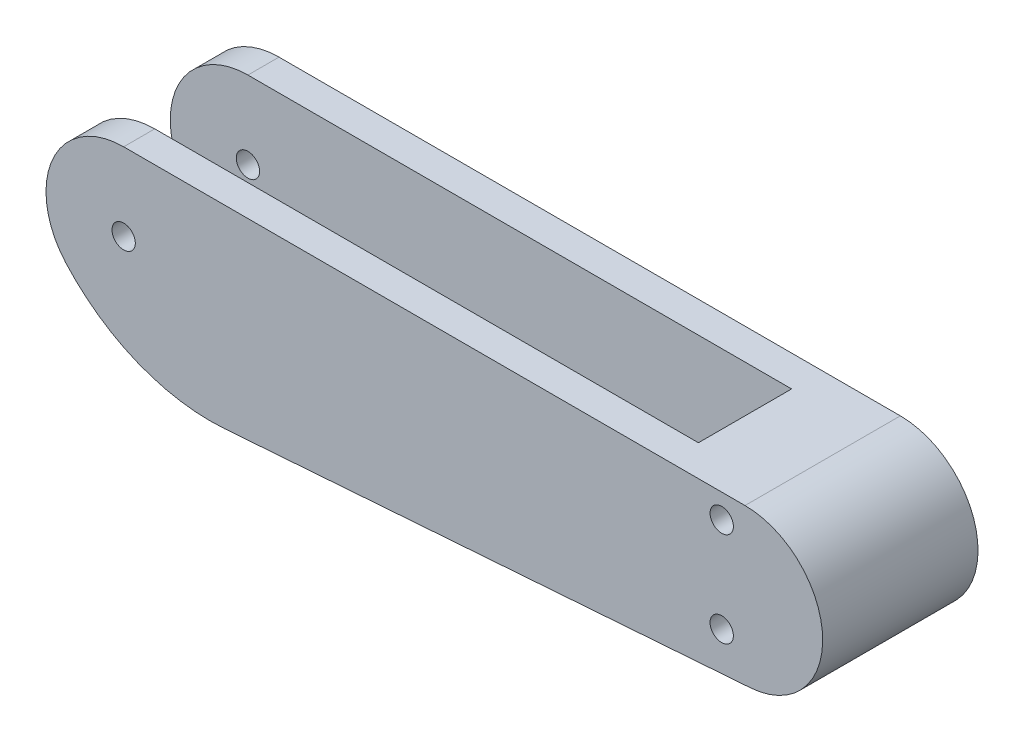
ISO-10303-21;
HEADER;
FILE_DESCRIPTION(('STEP AP214'),'2;1');
FILE_NAME('part.step','',(''),(''),'','','');
FILE_SCHEMA(('AUTOMOTIVE_DESIGN { 1 0 10303 214 1 1 1 1 }'));
ENDSEC;
DATA;
#1=APPLICATION_CONTEXT('core data for automotive mechanical design processes');
#2=APPLICATION_PROTOCOL_DEFINITION('international standard','automotive_design',2000,#1);
#3=PRODUCT_CONTEXT('',#1,'mechanical');
#4=PRODUCT('Part','Part','',(#3));
#5=PRODUCT_RELATED_PRODUCT_CATEGORY('part','',(#4));
#6=PRODUCT_DEFINITION_FORMATION('','',#4);
#7=PRODUCT_DEFINITION_CONTEXT('part definition',#1,'design');
#8=PRODUCT_DEFINITION('design','',#6,#7);
#9=PRODUCT_DEFINITION_SHAPE('','',#8);
#10=(LENGTH_UNIT() NAMED_UNIT(*) SI_UNIT(.MILLI.,.METRE.));
#11=(NAMED_UNIT(*) PLANE_ANGLE_UNIT() SI_UNIT($,.RADIAN.));
#12=(NAMED_UNIT(*) SI_UNIT($,.STERADIAN.) SOLID_ANGLE_UNIT());
#13=UNCERTAINTY_MEASURE_WITH_UNIT(LENGTH_MEASURE(1.E-05),#10,'distance_accuracy_value','');
#14=(GEOMETRIC_REPRESENTATION_CONTEXT(3) GLOBAL_UNCERTAINTY_ASSIGNED_CONTEXT((#13)) GLOBAL_UNIT_ASSIGNED_CONTEXT((#10,
#11,#12)) REPRESENTATION_CONTEXT('',''));
#15=CARTESIAN_POINT('',(0.,0.,0.));
#16=DIRECTION('',(0.,0.,1.));
#17=DIRECTION('',(1.,0.,0.));
#18=AXIS2_PLACEMENT_3D('',#15,#16,#17);
#19=CARTESIAN_POINT('',(43.6280332940909,10.,10.));
#20=DIRECTION('',(0.,-1.,0.));
#21=DIRECTION('',(1.,0.,0.));
#22=AXIS2_PLACEMENT_3D('',#19,#20,#21);
#23=PLANE('',#22);
#24=DIRECTION('',(1.,0.,0.));
#25=VECTOR('',#24,1.);
#26=CARTESIAN_POINT('',(-70.,10.,-6.));
#27=LINE('',#26,#25);
#28=CARTESIAN_POINT('',(0.,10.,-6.));
#29=VERTEX_POINT('',#28);
#30=CARTESIAN_POINT('',(70.,10.,-6.));
#31=VERTEX_POINT('',#30);
#32=EDGE_CURVE('E226',#29,#31,#27,.T.);
#33=ORIENTED_EDGE('',*,*,#32,.T.);
#34=DIRECTION('',(0.,0.,1.));
#35=VECTOR('',#34,1.);
#36=CARTESIAN_POINT('',(70.,10.,-6.));
#37=LINE('',#36,#35);
#38=CARTESIAN_POINT('',(70.,10.,6.));
#39=VERTEX_POINT('',#38);
#40=EDGE_CURVE('E230',#31,#39,#37,.T.);
#41=ORIENTED_EDGE('',*,*,#40,.T.);
#42=DIRECTION('',(1.,0.,0.));
#43=VECTOR('',#42,1.);
#44=CARTESIAN_POINT('',(-70.,10.,6.));
#45=LINE('',#44,#43);
#46=CARTESIAN_POINT('',(0.,10.,6.));
#47=VERTEX_POINT('',#46);
#48=EDGE_CURVE('E239',#47,#39,#45,.T.);
#49=ORIENTED_EDGE('',*,*,#48,.F.);
#50=DIRECTION('',(0.,0.,-1.));
#51=VECTOR('',#50,1.);
#52=CARTESIAN_POINT('',(0.,10.,10.));
#53=LINE('',#52,#51);
#54=CARTESIAN_POINT('',(0.,10.,10.));
#55=VERTEX_POINT('',#54);
#56=EDGE_CURVE('E41',#55,#47,#53,.T.);
#57=ORIENTED_EDGE('',*,*,#56,.F.);
#58=DIRECTION('',(-1.,0.,0.));
#59=VECTOR('',#58,1.);
#60=CARTESIAN_POINT('',(80.,10.,10.));
#61=LINE('',#60,#59);
#62=CARTESIAN_POINT('',(80.,10.,10.));
#63=VERTEX_POINT('',#62);
#64=EDGE_CURVE('E87',#63,#55,#61,.T.);
#65=ORIENTED_EDGE('',*,*,#64,.F.);
#66=DIRECTION('',(0.,0.,-1.));
#67=VECTOR('',#66,1.);
#68=CARTESIAN_POINT('',(80.,10.,10.));
#69=LINE('',#68,#67);
#70=CARTESIAN_POINT('',(80.,10.,-10.));
#71=VERTEX_POINT('',#70);
#72=EDGE_CURVE('E124',#63,#71,#69,.T.);
#73=ORIENTED_EDGE('',*,*,#72,.T.);
#74=DIRECTION('',(-1.,0.,0.));
#75=VECTOR('',#74,1.);
#76=CARTESIAN_POINT('',(43.6280332940909,10.,-10.));
#77=LINE('',#76,#75);
#78=CARTESIAN_POINT('',(0.,10.,-10.));
#79=VERTEX_POINT('',#78);
#80=EDGE_CURVE('E81',#71,#79,#77,.T.);
#81=ORIENTED_EDGE('',*,*,#80,.T.);
#82=EDGE_CURVE('E145',#29,#79,#53,.T.);
#83=ORIENTED_EDGE('',*,*,#82,.F.);
#84=EDGE_LOOP('',(#33,#41,#49,#57,#65,#73,#81,#83));
#85=FACE_BOUND('',#84,.T.);
#86=ADVANCED_FACE('F34',(#85),#23,.F.);
#87=CARTESIAN_POINT('',(0.,0.,10.));
#88=DIRECTION('',(0.,0.,-1.));
#89=DIRECTION('',(-1.,0.,0.));
#90=AXIS2_PLACEMENT_3D('',#87,#88,#89);
#91=CYLINDRICAL_SURFACE('',#90,10.);
#92=CARTESIAN_POINT('',(0.,0.,-6.));
#93=DIRECTION('',(0.,0.,1.));
#94=DIRECTION('',(1.,0.,0.));
#95=AXIS2_PLACEMENT_3D('',#92,#93,#94);
#96=CIRCLE('',#95,10.);
#97=CARTESIAN_POINT('',(-7.4535599249993,-6.66666666666667,-6.));
#98=VERTEX_POINT('',#97);
#99=EDGE_CURVE('E171',#29,#98,#96,.T.);
#100=ORIENTED_EDGE('',*,*,#99,.F.);
#101=ORIENTED_EDGE('',*,*,#82,.T.);
#102=CARTESIAN_POINT('',(0.,0.,-10.));
#103=DIRECTION('',(0.,0.,1.));
#104=DIRECTION('',(1.,0.,0.));
#105=AXIS2_PLACEMENT_3D('',#102,#103,#104);
#106=CIRCLE('',#105,10.);
#107=CARTESIAN_POINT('',(-7.4535599249993,-6.66666666666667,-10.));
#108=VERTEX_POINT('',#107);
#109=EDGE_CURVE('E129',#79,#108,#106,.T.);
#110=ORIENTED_EDGE('',*,*,#109,.T.);
#111=DIRECTION('',(0.,0.,-1.));
#112=VECTOR('',#111,1.);
#113=CARTESIAN_POINT('',(-7.4535599249993,-6.66666666666667,10.));
#114=LINE('',#113,#112);
#115=EDGE_CURVE('E116',#98,#108,#114,.T.);
#116=ORIENTED_EDGE('',*,*,#115,.F.);
#117=EDGE_LOOP('',(#100,#101,#110,#116));
#118=FACE_BOUND('',#117,.T.);
#119=ADVANCED_FACE('F214',(#118),#91,.T.);
#120=CARTESIAN_POINT('',(11.1803398874989,10.,10.));
#121=DIRECTION('',(0.,0.,-1.));
#122=DIRECTION('',(-1.,0.,0.));
#123=AXIS2_PLACEMENT_3D('',#120,#121,#122);
#124=CYLINDRICAL_SURFACE('',#123,25.);
#125=CARTESIAN_POINT('',(11.1803398874989,10.,-6.));
#126=DIRECTION('',(0.,0.,1.));
#127=DIRECTION('',(1.,0.,0.));
#128=AXIS2_PLACEMENT_3D('',#125,#126,#127);
#129=CIRCLE('',#128,25.);
#130=CARTESIAN_POINT('',(13.0063846477822,-14.9332220247092,-6.));
#131=VERTEX_POINT('',#130);
#132=EDGE_CURVE('E159',#98,#131,#129,.T.);
#133=ORIENTED_EDGE('',*,*,#132,.F.);
#134=ORIENTED_EDGE('',*,*,#115,.T.);
#135=CARTESIAN_POINT('',(11.1803398874989,10.,-10.));
#136=DIRECTION('',(0.,0.,1.));
#137=DIRECTION('',(1.,0.,0.));
#138=AXIS2_PLACEMENT_3D('',#135,#136,#137);
#139=CIRCLE('',#138,25.);
#140=CARTESIAN_POINT('',(13.0063846477822,-14.9332220247092,-10.));
#141=VERTEX_POINT('',#140);
#142=EDGE_CURVE('E133',#108,#141,#139,.T.);
#143=ORIENTED_EDGE('',*,*,#142,.T.);
#144=DIRECTION('',(0.,0.,-1.));
#145=VECTOR('',#144,1.);
#146=CARTESIAN_POINT('',(13.0063846477822,-14.9332220247092,10.));
#147=LINE('',#146,#145);
#148=EDGE_CURVE('E117',#131,#141,#147,.T.);
#149=ORIENTED_EDGE('',*,*,#148,.F.);
#150=EDGE_LOOP('',(#133,#134,#143,#149));
#151=FACE_BOUND('',#150,.T.);
#152=ADVANCED_FACE('F219',(#151),#124,.T.);
#153=CARTESIAN_POINT('',(-7.4535599249993,-6.66666666666667,10.));
#154=VERTEX_POINT('',#153);
#155=CARTESIAN_POINT('',(-7.4535599249993,-6.66666666666667,6.));
#156=VERTEX_POINT('',#155);
#157=EDGE_CURVE('E143',#154,#156,#114,.T.);
#158=ORIENTED_EDGE('',*,*,#157,.T.);
#159=CARTESIAN_POINT('',(11.1803398874989,10.,6.));
#160=DIRECTION('',(0.,0.,1.));
#161=DIRECTION('',(1.,0.,0.));
#162=AXIS2_PLACEMENT_3D('',#159,#160,#161);
#163=CIRCLE('',#162,25.);
#164=CARTESIAN_POINT('',(13.0063846477822,-14.9332220247092,6.));
#165=VERTEX_POINT('',#164);
#166=EDGE_CURVE('E113',#156,#165,#163,.T.);
#167=ORIENTED_EDGE('',*,*,#166,.T.);
#168=CARTESIAN_POINT('',(13.0063846477822,-14.9332220247092,10.));
#169=VERTEX_POINT('',#168);
#170=EDGE_CURVE('E109',#169,#165,#147,.T.);
#171=ORIENTED_EDGE('',*,*,#170,.F.);
#172=CARTESIAN_POINT('',(11.1803398874989,10.,10.));
#173=DIRECTION('',(0.,0.,1.));
#174=DIRECTION('',(1.,0.,0.));
#175=AXIS2_PLACEMENT_3D('',#172,#173,#174);
#176=CIRCLE('',#175,25.);
#177=EDGE_CURVE('E94',#154,#169,#176,.T.);
#178=ORIENTED_EDGE('',*,*,#177,.F.);
#179=EDGE_LOOP('',(#158,#167,#171,#178));
#180=FACE_BOUND('',#179,.T.);
#181=ADVANCED_FACE('F110',(#180),#124,.T.);
#182=CARTESIAN_POINT('',(13.0063846477822,-14.9332220247092,10.));
#183=DIRECTION('',(-0.073041790411331,0.997328880988366,0.));
#184=DIRECTION('',(-0.997328880988367,-0.073041790411331,0.));
#185=AXIS2_PLACEMENT_3D('',#182,#183,#184);
#186=PLANE('',#185);
#187=DIRECTION('',(0.997328880988367,0.073041790411331,0.));
#188=VECTOR('',#187,1.);
#189=CARTESIAN_POINT('',(13.0063846477822,-14.9332220247092,-6.));
#190=LINE('',#189,#188);
#191=CARTESIAN_POINT('',(70.,-10.7591568926384,-6.));
#192=VERTEX_POINT('',#191);
#193=EDGE_CURVE('E154',#131,#192,#190,.T.);
#194=ORIENTED_EDGE('',*,*,#193,.F.);
#195=ORIENTED_EDGE('',*,*,#148,.T.);
#196=DIRECTION('',(0.997328880988366,0.073041790411331,0.));
#197=VECTOR('',#196,1.);
#198=CARTESIAN_POINT('',(13.0063846477822,-14.9332220247092,-10.));
#199=LINE('',#198,#197);
#200=CARTESIAN_POINT('',(80.7304179041133,-9.97328880988366,-10.));
#201=VERTEX_POINT('',#200);
#202=EDGE_CURVE('E136',#141,#201,#199,.T.);
#203=ORIENTED_EDGE('',*,*,#202,.T.);
#204=DIRECTION('',(0.,0.,-1.));
#205=VECTOR('',#204,1.);
#206=CARTESIAN_POINT('',(80.7304179041133,-9.97328880988366,10.));
#207=LINE('',#206,#205);
#208=CARTESIAN_POINT('',(80.7304179041133,-9.97328880988366,10.));
#209=VERTEX_POINT('',#208);
#210=EDGE_CURVE('E122',#209,#201,#207,.T.);
#211=ORIENTED_EDGE('',*,*,#210,.F.);
#212=DIRECTION('',(0.997328880988366,0.073041790411331,0.));
#213=VECTOR('',#212,1.);
#214=CARTESIAN_POINT('',(13.0063846477822,-14.9332220247092,10.));
#215=LINE('',#214,#213);
#216=EDGE_CURVE('E99',#169,#209,#215,.T.);
#217=ORIENTED_EDGE('',*,*,#216,.F.);
#218=ORIENTED_EDGE('',*,*,#170,.T.);
#219=DIRECTION('',(0.997328880988367,0.073041790411331,0.));
#220=VECTOR('',#219,1.);
#221=CARTESIAN_POINT('',(13.0063846477822,-14.9332220247092,6.));
#222=LINE('',#221,#220);
#223=CARTESIAN_POINT('',(70.,-10.7591568926384,6.));
#224=VERTEX_POINT('',#223);
#225=EDGE_CURVE('E150',#165,#224,#222,.T.);
#226=ORIENTED_EDGE('',*,*,#225,.T.);
#227=DIRECTION('',(0.,0.,1.));
#228=VECTOR('',#227,1.);
#229=CARTESIAN_POINT('',(70.,-10.7591568926384,10.));
#230=LINE('',#229,#228);
#231=EDGE_CURVE('E11',#192,#224,#230,.T.);
#232=ORIENTED_EDGE('',*,*,#231,.F.);
#233=EDGE_LOOP('',(#194,#195,#203,#211,#217,#218,#226,#232));
#234=FACE_BOUND('',#233,.T.);
#235=ADVANCED_FACE('F120',(#234),#186,.F.);
#236=CARTESIAN_POINT('',(0.,0.,10.));
#237=DIRECTION('',(0.,0.,-1.));
#238=DIRECTION('',(-1.,0.,0.));
#239=AXIS2_PLACEMENT_3D('',#236,#237,#238);
#240=CYLINDRICAL_SURFACE('',#239,1.5);
#241=CARTESIAN_POINT('',(0.,0.,-10.));
#242=DIRECTION('',(0.,0.,1.));
#243=DIRECTION('',(1.,0.,0.));
#244=AXIS2_PLACEMENT_3D('',#241,#242,#243);
#245=CIRCLE('',#244,1.5);
#246=CARTESIAN_POINT('',(1.5,0.,-10.));
#247=VERTEX_POINT('',#246);
#248=EDGE_CURVE('E174',#247,#247,#245,.T.);
#249=ORIENTED_EDGE('',*,*,#248,.F.);
#250=EDGE_LOOP('',(#249));
#251=FACE_BOUND('',#250,.T.);
#252=CARTESIAN_POINT('',(0.,0.,-6.));
#253=DIRECTION('',(0.,0.,1.));
#254=DIRECTION('',(1.,0.,0.));
#255=AXIS2_PLACEMENT_3D('',#252,#253,#254);
#256=CIRCLE('',#255,1.5);
#257=CARTESIAN_POINT('',(1.5,0.,-6.));
#258=VERTEX_POINT('',#257);
#259=EDGE_CURVE('E152',#258,#258,#256,.T.);
#260=ORIENTED_EDGE('',*,*,#259,.T.);
#261=EDGE_LOOP('',(#260));
#262=FACE_BOUND('',#261,.T.);
#263=ADVANCED_FACE('F268',(#251,#262),#240,.F.);
#264=CARTESIAN_POINT('',(0.,0.,10.));
#265=DIRECTION('',(0.,0.,1.));
#266=DIRECTION('',(1.,0.,0.));
#267=AXIS2_PLACEMENT_3D('',#264,#265,#266);
#268=PLANE('',#267);
#269=CARTESIAN_POINT('',(77.,6.90494315212425,10.));
#270=DIRECTION('',(0.,0.,1.));
#271=DIRECTION('',(1.,0.,0.));
#272=AXIS2_PLACEMENT_3D('',#269,#270,#271);
#273=CIRCLE('',#272,1.5);
#274=CARTESIAN_POINT('',(78.5,6.90494315212425,10.));
#275=VERTEX_POINT('',#274);
#276=EDGE_CURVE('E181',#275,#275,#273,.T.);
#277=ORIENTED_EDGE('',*,*,#276,.F.);
#278=EDGE_LOOP('',(#277));
#279=FACE_BOUND('',#278,.T.);
#280=ORIENTED_EDGE('',*,*,#64,.T.);
#281=CARTESIAN_POINT('',(0.,0.,10.));
#282=DIRECTION('',(0.,0.,1.));
#283=DIRECTION('',(1.,0.,0.));
#284=AXIS2_PLACEMENT_3D('',#281,#282,#283);
#285=CIRCLE('',#284,10.);
#286=EDGE_CURVE('E102',#55,#154,#285,.T.);
#287=ORIENTED_EDGE('',*,*,#286,.T.);
#288=ORIENTED_EDGE('',*,*,#177,.T.);
#289=ORIENTED_EDGE('',*,*,#216,.T.);
#290=CARTESIAN_POINT('',(80.,0.,10.));
#291=DIRECTION('',(0.,0.,1.));
#292=DIRECTION('',(1.,0.,0.));
#293=AXIS2_PLACEMENT_3D('',#290,#291,#292);
#294=CIRCLE('',#293,10.);
#295=EDGE_CURVE('E56',#209,#63,#294,.T.);
#296=ORIENTED_EDGE('',*,*,#295,.T.);
#297=EDGE_LOOP('',(#280,#287,#288,#289,#296));
#298=FACE_BOUND('',#297,.T.);
#299=CARTESIAN_POINT('',(77.,-5.28301381617868,10.));
#300=DIRECTION('',(0.,0.,1.));
#301=DIRECTION('',(1.,0.,0.));
#302=AXIS2_PLACEMENT_3D('',#299,#300,#301);
#303=CIRCLE('',#302,1.5);
#304=CARTESIAN_POINT('',(78.5,-5.28301381617868,10.));
#305=VERTEX_POINT('',#304);
#306=EDGE_CURVE('E130',#305,#305,#303,.T.);
#307=ORIENTED_EDGE('',*,*,#306,.F.);
#308=EDGE_LOOP('',(#307));
#309=FACE_BOUND('',#308,.T.);
#310=CARTESIAN_POINT('',(0.,0.,10.));
#311=DIRECTION('',(0.,0.,1.));
#312=DIRECTION('',(1.,0.,0.));
#313=AXIS2_PLACEMENT_3D('',#310,#311,#312);
#314=CIRCLE('',#313,1.5);
#315=CARTESIAN_POINT('',(1.5,0.,10.));
#316=VERTEX_POINT('',#315);
#317=EDGE_CURVE('E175',#316,#316,#314,.T.);
#318=ORIENTED_EDGE('',*,*,#317,.F.);
#319=EDGE_LOOP('',(#318));
#320=FACE_BOUND('',#319,.T.);
#321=ADVANCED_FACE('F96',(#279,#298,#309,#320),#268,.T.);
#322=CARTESIAN_POINT('',(0.,0.,-10.));
#323=DIRECTION('',(0.,0.,1.));
#324=DIRECTION('',(1.,0.,0.));
#325=AXIS2_PLACEMENT_3D('',#322,#323,#324);
#326=PLANE('',#325);
#327=ORIENTED_EDGE('',*,*,#80,.F.);
#328=CARTESIAN_POINT('',(80.,0.,-10.));
#329=DIRECTION('',(0.,0.,1.));
#330=DIRECTION('',(1.,0.,0.));
#331=AXIS2_PLACEMENT_3D('',#328,#329,#330);
#332=CIRCLE('',#331,10.);
#333=EDGE_CURVE('E138',#201,#71,#332,.T.);
#334=ORIENTED_EDGE('',*,*,#333,.F.);
#335=ORIENTED_EDGE('',*,*,#202,.F.);
#336=ORIENTED_EDGE('',*,*,#142,.F.);
#337=ORIENTED_EDGE('',*,*,#109,.F.);
#338=EDGE_LOOP('',(#327,#334,#335,#336,#337));
#339=FACE_BOUND('',#338,.T.);
#340=CARTESIAN_POINT('',(77.,-5.28301381617868,-10.));
#341=DIRECTION('',(0.,0.,1.));
#342=DIRECTION('',(1.,0.,0.));
#343=AXIS2_PLACEMENT_3D('',#340,#341,#342);
#344=CIRCLE('',#343,1.5);
#345=CARTESIAN_POINT('',(78.5,-5.28301381617868,-10.));
#346=VERTEX_POINT('',#345);
#347=EDGE_CURVE('E184',#346,#346,#344,.T.);
#348=ORIENTED_EDGE('',*,*,#347,.T.);
#349=EDGE_LOOP('',(#348));
#350=FACE_BOUND('',#349,.T.);
#351=CARTESIAN_POINT('',(77.,6.90494315212425,-10.));
#352=DIRECTION('',(0.,0.,1.));
#353=DIRECTION('',(1.,0.,0.));
#354=AXIS2_PLACEMENT_3D('',#351,#352,#353);
#355=CIRCLE('',#354,1.5);
#356=CARTESIAN_POINT('',(78.5,6.90494315212425,-10.));
#357=VERTEX_POINT('',#356);
#358=EDGE_CURVE('E178',#357,#357,#355,.T.);
#359=ORIENTED_EDGE('',*,*,#358,.T.);
#360=EDGE_LOOP('',(#359));
#361=FACE_BOUND('',#360,.T.);
#362=ORIENTED_EDGE('',*,*,#248,.T.);
#363=EDGE_LOOP('',(#362));
#364=FACE_BOUND('',#363,.T.);
#365=ADVANCED_FACE('F193',(#339,#350,#361,#364),#326,.F.);
#366=ORIENTED_EDGE('',*,*,#56,.T.);
#367=CARTESIAN_POINT('',(0.,0.,6.));
#368=DIRECTION('',(0.,0.,1.));
#369=DIRECTION('',(1.,0.,0.));
#370=AXIS2_PLACEMENT_3D('',#367,#368,#369);
#371=CIRCLE('',#370,10.);
#372=EDGE_CURVE('E155',#47,#156,#371,.T.);
#373=ORIENTED_EDGE('',*,*,#372,.T.);
#374=ORIENTED_EDGE('',*,*,#157,.F.);
#375=ORIENTED_EDGE('',*,*,#286,.F.);
#376=EDGE_LOOP('',(#366,#373,#374,#375));
#377=FACE_BOUND('',#376,.T.);
#378=ADVANCED_FACE('F209',(#377),#91,.T.);
#379=CARTESIAN_POINT('',(80.,0.,10.));
#380=DIRECTION('',(0.,0.,-1.));
#381=DIRECTION('',(-1.,0.,0.));
#382=AXIS2_PLACEMENT_3D('',#379,#380,#381);
#383=CYLINDRICAL_SURFACE('',#382,10.);
#384=ORIENTED_EDGE('',*,*,#333,.T.);
#385=ORIENTED_EDGE('',*,*,#72,.F.);
#386=ORIENTED_EDGE('',*,*,#295,.F.);
#387=ORIENTED_EDGE('',*,*,#210,.T.);
#388=EDGE_LOOP('',(#384,#385,#386,#387));
#389=FACE_BOUND('',#388,.T.);
#390=ADVANCED_FACE('F199',(#389),#383,.T.);
#391=CARTESIAN_POINT('',(77.,-5.28301381617868,10.));
#392=DIRECTION('',(0.,0.,-1.));
#393=DIRECTION('',(-1.,0.,0.));
#394=AXIS2_PLACEMENT_3D('',#391,#392,#393);
#395=CYLINDRICAL_SURFACE('',#394,1.5);
#396=ORIENTED_EDGE('',*,*,#306,.T.);
#397=EDGE_LOOP('',(#396));
#398=FACE_BOUND('',#397,.T.);
#399=ORIENTED_EDGE('',*,*,#347,.F.);
#400=EDGE_LOOP('',(#399));
#401=FACE_BOUND('',#400,.T.);
#402=ADVANCED_FACE('F196',(#398,#401),#395,.F.);
#403=CARTESIAN_POINT('',(77.,6.90494315212425,10.));
#404=DIRECTION('',(0.,0.,-1.));
#405=DIRECTION('',(-1.,0.,0.));
#406=AXIS2_PLACEMENT_3D('',#403,#404,#405);
#407=CYLINDRICAL_SURFACE('',#406,1.5);
#408=ORIENTED_EDGE('',*,*,#276,.T.);
#409=EDGE_LOOP('',(#408));
#410=FACE_BOUND('',#409,.T.);
#411=ORIENTED_EDGE('',*,*,#358,.F.);
#412=EDGE_LOOP('',(#411));
#413=FACE_BOUND('',#412,.T.);
#414=ADVANCED_FACE('F198',(#410,#413),#407,.F.);
#415=CARTESIAN_POINT('',(0.,0.,6.));
#416=DIRECTION('',(0.,0.,1.));
#417=DIRECTION('',(1.,0.,0.));
#418=AXIS2_PLACEMENT_3D('',#415,#416,#417);
#419=CIRCLE('',#418,1.5);
#420=CARTESIAN_POINT('',(1.5,0.,6.));
#421=VERTEX_POINT('',#420);
#422=EDGE_CURVE('E148',#421,#421,#419,.T.);
#423=ORIENTED_EDGE('',*,*,#422,.F.);
#424=EDGE_LOOP('',(#423));
#425=FACE_BOUND('',#424,.T.);
#426=ORIENTED_EDGE('',*,*,#317,.T.);
#427=EDGE_LOOP('',(#426));
#428=FACE_BOUND('',#427,.T.);
#429=ADVANCED_FACE('F206',(#425,#428),#240,.F.);
#430=CARTESIAN_POINT('',(70.,-15.,-6.));
#431=DIRECTION('',(-1.,0.,0.));
#432=DIRECTION('',(0.,0.,1.));
#433=AXIS2_PLACEMENT_3D('',#430,#431,#432);
#434=PLANE('',#433);
#435=ORIENTED_EDGE('',*,*,#231,.T.);
#436=DIRECTION('',(0.,1.,0.));
#437=VECTOR('',#436,1.);
#438=CARTESIAN_POINT('',(70.,-15.,6.));
#439=LINE('',#438,#437);
#440=EDGE_CURVE('E48',#224,#39,#439,.T.);
#441=ORIENTED_EDGE('',*,*,#440,.T.);
#442=ORIENTED_EDGE('',*,*,#40,.F.);
#443=DIRECTION('',(0.,1.,0.));
#444=VECTOR('',#443,1.);
#445=CARTESIAN_POINT('',(70.,-15.,-6.));
#446=LINE('',#445,#444);
#447=EDGE_CURVE('E151',#192,#31,#446,.T.);
#448=ORIENTED_EDGE('',*,*,#447,.F.);
#449=EDGE_LOOP('',(#435,#441,#442,#448));
#450=FACE_BOUND('',#449,.T.);
#451=ADVANCED_FACE('F285',(#450),#434,.T.);
#452=CARTESIAN_POINT('',(-70.,-15.,-6.));
#453=DIRECTION('',(0.,0.,1.));
#454=DIRECTION('',(1.,0.,0.));
#455=AXIS2_PLACEMENT_3D('',#452,#453,#454);
#456=PLANE('',#455);
#457=ORIENTED_EDGE('',*,*,#259,.F.);
#458=EDGE_LOOP('',(#457));
#459=FACE_BOUND('',#458,.T.);
#460=ORIENTED_EDGE('',*,*,#99,.T.);
#461=ORIENTED_EDGE('',*,*,#132,.T.);
#462=ORIENTED_EDGE('',*,*,#193,.T.);
#463=ORIENTED_EDGE('',*,*,#447,.T.);
#464=ORIENTED_EDGE('',*,*,#32,.F.);
#465=EDGE_LOOP('',(#460,#461,#462,#463,#464));
#466=FACE_BOUND('',#465,.T.);
#467=ADVANCED_FACE('F253',(#459,#466),#456,.T.);
#468=CARTESIAN_POINT('',(-70.,-15.,6.));
#469=DIRECTION('',(0.,0.,1.));
#470=DIRECTION('',(1.,0.,0.));
#471=AXIS2_PLACEMENT_3D('',#468,#469,#470);
#472=PLANE('',#471);
#473=ORIENTED_EDGE('',*,*,#422,.T.);
#474=EDGE_LOOP('',(#473));
#475=FACE_BOUND('',#474,.T.);
#476=ORIENTED_EDGE('',*,*,#48,.T.);
#477=ORIENTED_EDGE('',*,*,#440,.F.);
#478=ORIENTED_EDGE('',*,*,#225,.F.);
#479=ORIENTED_EDGE('',*,*,#166,.F.);
#480=ORIENTED_EDGE('',*,*,#372,.F.);
#481=EDGE_LOOP('',(#476,#477,#478,#479,#480));
#482=FACE_BOUND('',#481,.T.);
#483=ADVANCED_FACE('F245',(#475,#482),#472,.F.);
#484=CLOSED_SHELL('',(#86,#119,#152,#181,#235,#263,#321,#365,#378,#390,#402,#414,#429,#451,#467,#483));
#485=MANIFOLD_SOLID_BREP('B2',#484);
#486=ADVANCED_BREP_SHAPE_REPRESENTATION('',(#18,#485),#14);
#487=SHAPE_DEFINITION_REPRESENTATION(#9,#486);
ENDSEC;
END-ISO-10303-21;
